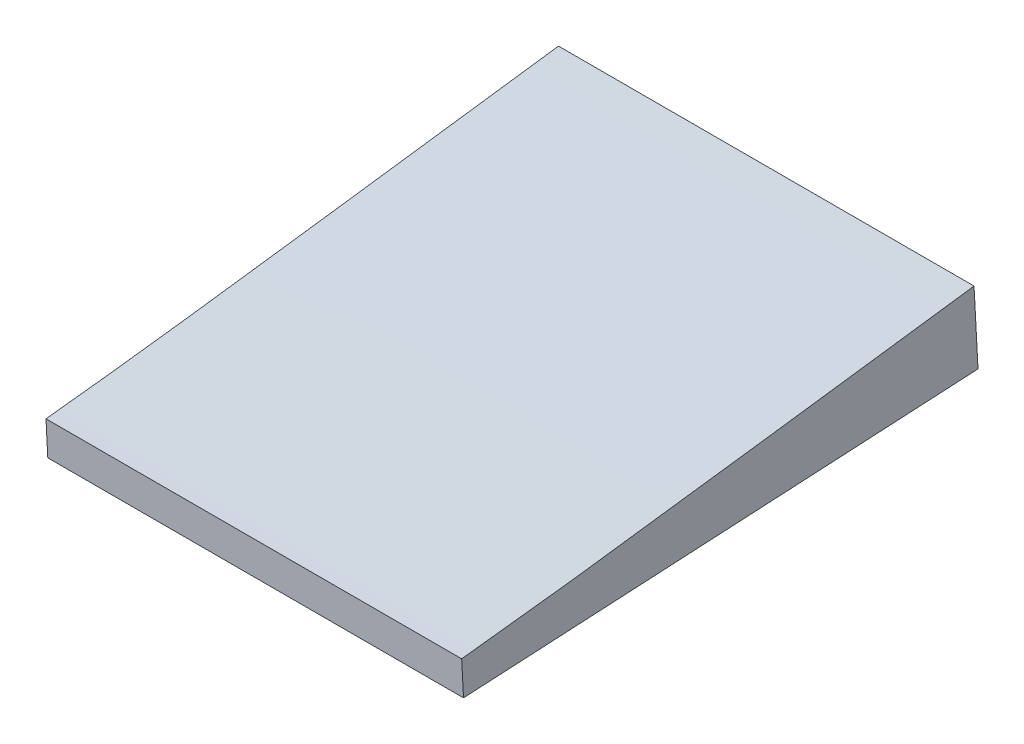
ISO-10303-21;
HEADER;
FILE_DESCRIPTION(('STEP AP214'),'2;1');
FILE_NAME('part.step','',(''),(''),'','','');
FILE_SCHEMA(('AUTOMOTIVE_DESIGN { 1 0 10303 214 1 1 1 1 }'));
ENDSEC;
DATA;
#1=APPLICATION_CONTEXT('core data for automotive mechanical design processes');
#2=APPLICATION_PROTOCOL_DEFINITION('international standard','automotive_design',2000,#1);
#3=PRODUCT_CONTEXT('',#1,'mechanical');
#4=PRODUCT('Part','Part','',(#3));
#5=PRODUCT_RELATED_PRODUCT_CATEGORY('part','',(#4));
#6=PRODUCT_DEFINITION_FORMATION('','',#4);
#7=PRODUCT_DEFINITION_CONTEXT('part definition',#1,'design');
#8=PRODUCT_DEFINITION('design','',#6,#7);
#9=PRODUCT_DEFINITION_SHAPE('','',#8);
#10=(LENGTH_UNIT() NAMED_UNIT(*) SI_UNIT(.MILLI.,.METRE.));
#11=(NAMED_UNIT(*) PLANE_ANGLE_UNIT() SI_UNIT($,.RADIAN.));
#12=(NAMED_UNIT(*) SI_UNIT($,.STERADIAN.) SOLID_ANGLE_UNIT());
#13=UNCERTAINTY_MEASURE_WITH_UNIT(LENGTH_MEASURE(1.E-05),#10,'distance_accuracy_value','');
#14=(GEOMETRIC_REPRESENTATION_CONTEXT(3) GLOBAL_UNCERTAINTY_ASSIGNED_CONTEXT((#13)) GLOBAL_UNIT_ASSIGNED_CONTEXT((#10,
#11,#12)) REPRESENTATION_CONTEXT('',''));
#15=CARTESIAN_POINT('',(0.,0.,0.));
#16=DIRECTION('',(0.,0.,1.));
#17=DIRECTION('',(1.,0.,0.));
#18=AXIS2_PLACEMENT_3D('',#15,#16,#17);
#19=CARTESIAN_POINT('',(-177.805848873745,-43.688210722732,-115.550179040921));
#20=DIRECTION('',(-2.29475219963646E-07,0.0534934907984705,-0.998568198192863));
#21=DIRECTION('',(0.,0.99856819819289,0.053493490798472));
#22=AXIS2_PLACEMENT_3D('',#19,#20,#21);
#23=PLANE('',#22);
#24=CARTESIAN_POINT('',(-339.424320676004,-41.2286300415403,-115.418381689263));
#25=CARTESIAN_POINT('',(-312.486933896687,-41.2286599807383,-115.418389483438));
#26=CARTESIAN_POINT('',(-285.549547117365,-41.2286808422066,-115.418396791316));
#27=CARTESIAN_POINT('',(-231.674773558697,-41.2287044096837,-115.418410434483));
#28=CARTESIAN_POINT('',(-204.737386779351,-41.2287071156926,-115.41841676977));
#29=CARTESIAN_POINT('',(-177.8,-41.2287007439717,-115.418422618762));
#30=B_SPLINE_CURVE_WITH_KNOTS('',3,(#24,#25,#26,#27,#28,#29),.UNSPECIFIED.,.F.,.F.,(4,2,4),(0.,
80.8121603379917,161.624320676034),.UNSPECIFIED.);
#31=CARTESIAN_POINT('',(-338.453291853417,-41.2286313501884,-115.418381982514));
#32=VERTEX_POINT('',#31);
#33=CARTESIAN_POINT('',(-177.8,-41.2287007439717,-115.418422618762));
#34=VERTEX_POINT('',#33);
#35=EDGE_CURVE('E97',#32,#34,#30,.T.);
#36=ORIENTED_EDGE('',*,*,#35,.T.);
#37=DIRECTION('',(0.,-0.99856819819289,-0.053493490798472));
#38=VECTOR('',#37,1.);
#39=CARTESIAN_POINT('',(-177.8,6.04731605634461,-112.885837288814));
#40=LINE('',#39,#38);
#41=CARTESIAN_POINT('',(-177.8,-27.7854361643582,-114.698264347082));
#42=VERTEX_POINT('',#41);
#43=EDGE_CURVE('E70',#42,#34,#40,.T.);
#44=ORIENTED_EDGE('',*,*,#43,.F.);
#45=CARTESIAN_POINT('',(-177.8,-27.7854361642381,-114.698264347069));
#46=CARTESIAN_POINT('',(-231.674773558668,-27.7854374698395,-114.698252035584));
#47=CARTESIAN_POINT('',(-285.549547117336,-27.7854387754408,-114.698239724099));
#48=CARTESIAN_POINT('',(-339.424320676004,-27.7854400810422,-114.698227412614));
#49=B_SPLINE_CURVE_WITH_KNOTS('',3,(#45,#46,#47,#48),.UNSPECIFIED.,.F.,.F.,(4,4),(0.,
161.624320676009),.UNSPECIFIED.);
#50=CARTESIAN_POINT('',(-338.421323075372,-27.7854400567378,-114.698227641805));
#51=VERTEX_POINT('',#50);
#52=EDGE_CURVE('E90',#42,#51,#49,.T.);
#53=ORIENTED_EDGE('',*,*,#52,.T.);
#54=DIRECTION('',(0.0023746530409731,0.998565382766486,0.0534933394298316));
#55=VECTOR('',#54,1.);
#56=CARTESIAN_POINT('',(-338.458234976646,-43.3072641668652,-115.529734741914));
#57=LINE('',#56,#55);
#58=EDGE_CURVE('E11',#32,#51,#57,.T.);
#59=ORIENTED_EDGE('',*,*,#58,.F.);
#60=EDGE_LOOP('',(#36,#44,#53,#59));
#61=FACE_BOUND('',#60,.T.);
#62=ADVANCED_FACE('F42',(#61),#23,.F.);
#63=CARTESIAN_POINT('',(-338.458280662959,-32.6572237938514,-314.335074741631));
#64=DIRECTION('',(-0.999997180507466,0.0023712407330619,0.000127257626607295));
#65=DIRECTION('',(-0.00237124075226243,-0.999997188604695,0.));
#66=AXIS2_PLACEMENT_3D('',#63,#64,#65);
#67=PLANE('',#66);
#68=CARTESIAN_POINT('',(-338.453293983147,-41.72770935186,-106.135603463235));
#69=CARTESIAN_POINT('',(-338.453277965832,-37.9742532380857,-175.949342672558));
#70=CARTESIAN_POINT('',(-338.453261948516,-34.2207971243114,-245.763081881881));
#71=CARTESIAN_POINT('',(-338.453245931201,-30.4673410105371,-315.576821091204));
#72=B_SPLINE_CURVE_WITH_KNOTS('',3,(#68,#69,#70,#71),.UNSPECIFIED.,.F.,.F.,(4,4),(0.,
209.743699635223),.UNSPECIFIED.);
#73=CARTESIAN_POINT('',(-338.453246242115,-30.5401994156522,-314.221665338883));
#74=VERTEX_POINT('',#73);
#75=EDGE_CURVE('E99',#32,#74,#72,.T.);
#76=ORIENTED_EDGE('',*,*,#75,.F.);
#77=ORIENTED_EDGE('',*,*,#58,.T.);
#78=CARTESIAN_POINT('',(-338.384941198785,-1.66194015910152,-315.576821091204));
#79=CARTESIAN_POINT('',(-338.385075981672,-1.75779642906582,-314.849825098571));
#80=CARTESIAN_POINT('',(-338.385210296399,-1.85345665055141,-314.122803324417));
#81=CARTESIAN_POINT('',(-338.385478660586,-2.04466601525986,-312.668745061361));
#82=CARTESIAN_POINT('',(-338.385612710047,-2.14021515846762,-311.941708572457));
#83=CARTESIAN_POINT('',(-338.385881214696,-2.33148334352403,-310.487658046608));
#84=CARTESIAN_POINT('',(-338.386015669885,-2.42720238534448,-309.760644009661));
#85=CARTESIAN_POINT('',(-338.386285495478,-2.61902371671638,-308.306666538209));
#86=CARTESIAN_POINT('',(-338.386420865882,-2.71512600624027,-307.579703103701));
#87=CARTESIAN_POINT('',(-338.386692367703,-2.9076492289872,-306.125818907187));
#88=CARTESIAN_POINT('',(-338.38682849912,-3.00407016201006,-305.398898145154));
#89=CARTESIAN_POINT('',(-338.387101455729,-3.19720253669483,-303.945095182069));
#90=CARTESIAN_POINT('',(-338.387238280921,-3.29391397837079,-303.218212981017));
#91=CARTESIAN_POINT('',(-338.387649658327,-3.58442592179664,-301.037616703996));
#92=CARTESIAN_POINT('',(-338.387925112377,-3.77860404435833,-299.583952935944));
#93=CARTESIAN_POINT('',(-338.38847775922,-4.16768707481978,-296.67674607591));
#94=CARTESIAN_POINT('',(-338.388754951987,-4.36259197120865,-295.223202982386));
#95=CARTESIAN_POINT('',(-338.38931030481,-4.75280677039573,-292.316171164598));
#96=CARTESIAN_POINT('',(-338.389588464866,-4.94811667319807,-290.862682440334));
#97=CARTESIAN_POINT('',(-338.390145538201,-5.33905186907127,-287.955747069443));
#98=CARTESIAN_POINT('',(-338.39042445148,-5.5346771622134,-286.502300422826));
#99=CARTESIAN_POINT('',(-338.390983168281,-5.92630048417527,-283.595457371246));
#100=CARTESIAN_POINT('',(-338.391262971802,-6.12229851298897,-282.142060966282));
#101=CARTESIAN_POINT('',(-338.392103868066,-6.71091264371114,-277.781992930944));
#102=CARTESIAN_POINT('',(-338.392666453562,-7.10415374231775,-274.875405636536));
#103=CARTESIAN_POINT('',(-338.393795745934,-7.89236142527868,-269.062465411846));
#104=CARTESIAN_POINT('',(-338.394362452808,-8.28732800944506,-266.156112481539));
#105=CARTESIAN_POINT('',(-338.395498561383,-9.07838752378461,-260.343595067228));
#106=CARTESIAN_POINT('',(-338.396067963052,-9.4744804405583,-257.4374305814));
#107=CARTESIAN_POINT('',(-338.397208280786,-10.2673002889964,-251.625187970172));
#108=CARTESIAN_POINT('',(-338.397779196851,-10.664027220694,-248.719109844778));
#109=CARTESIAN_POINT('',(-338.398921301874,-11.4575933768576,-242.907005604515));
#110=CARTESIAN_POINT('',(-338.399492490828,-11.8544325998718,-240.000979489447));
#111=CARTESIAN_POINT('',(-338.400633866973,-12.647691653768,-234.188870043382));
#112=CARTESIAN_POINT('',(-338.401204054163,-13.0441114846577,-231.282786712385));
#113=CARTESIAN_POINT('',(-338.402341952756,-13.8359125822929,-225.470517138633));
#114=CARTESIAN_POINT('',(-338.40290966419,-14.23129386253,-222.564330897717));
#115=CARTESIAN_POINT('',(-338.4040411686,-15.0204158974013,-216.751735518881));
#116=CARTESIAN_POINT('',(-338.404604961576,-15.4141566520009,-213.845326380958));
#117=CARTESIAN_POINT('',(-338.405727251983,-16.1994308990891,-208.032024197792));
#118=CARTESIAN_POINT('',(-338.40628574908,-16.5909642516153,-205.125131133634));
#119=CARTESIAN_POINT('',(-338.407395820899,-17.3711325438039,-199.310955877394));
#120=CARTESIAN_POINT('',(-338.407947395622,-17.7597674835314,-196.403673685321));
#121=CARTESIAN_POINT('',(-338.409041456419,-18.5332296051219,-190.588641651748));
#122=CARTESIAN_POINT('',(-338.409583942615,-18.9180568373989,-187.68089181696));
#123=CARTESIAN_POINT('',(-338.410657742576,-19.6830327381025,-181.864776104681));
#124=CARTESIAN_POINT('',(-338.411189056342,-20.0631814061935,-178.956410227147));
#125=CARTESIAN_POINT('',(-338.412238440607,-20.8179304382488,-173.138995889079));
#126=CARTESIAN_POINT('',(-338.412756511276,-21.1925308730755,-170.229947437746));
#127=CARTESIAN_POINT('',(-338.413777164157,-21.9352444232203,-164.411022162955));
#128=CARTESIAN_POINT('',(-338.414279746371,-22.3033575396108,-161.501145339635));
#129=CARTESIAN_POINT('',(-338.415266494753,-23.0318695160244,-155.680420143007));
#130=CARTESIAN_POINT('',(-338.415750660889,-23.3922683631897,-152.769571768089));
#131=CARTESIAN_POINT('',(-338.416697722633,-24.1041544968884,-146.946782645827));
#132=CARTESIAN_POINT('',(-338.417160618229,-24.4556417784358,-144.034841897873));
#133=CARTESIAN_POINT('',(-338.418062339827,-25.1485368060939,-138.209636156986));
#134=CARTESIAN_POINT('',(-338.41850116482,-25.4899441289263,-135.296371113643));
#135=CARTESIAN_POINT('',(-338.419351672289,-26.1613824062099,-129.468533980613));
#136=CARTESIAN_POINT('',(-338.419763354814,-26.4914133812213,-126.553961893298));
#137=CARTESIAN_POINT('',(-338.420555630469,-27.1384608637312,-120.72301921962));
#138=CARTESIAN_POINT('',(-338.420936219899,-27.4554758202379,-117.806648460712));
#139=CARTESIAN_POINT('',(-338.421662371313,-28.0748186139008,-111.972330205906));
#140=CARTESIAN_POINT('',(-338.422007933071,-28.3771463564517,-109.054382699974));
#141=CARTESIAN_POINT('',(-338.422334036711,-28.6713128784201,-106.135603463235));
#142=B_SPLINE_CURVE_WITH_KNOTS('',3,(#78,#79,#80,#81,#82,#83,#84,#85,#86,#87,#88,#89,#90,#91,
#92,#93,#94,#95,#96,#97,#98,#99,#100,#101,#102,#103,#104,#105,#106,#107,#108,#109,#110,#111,
#112,#113,#114,#115,#116,#117,#118,#119,#120,#121,#122,#123,#124,#125,#126,#127,#128,#129,#130,
#131,#132,#133,#134,#135,#136,#137,#138,#139,#140,#141),.UNSPECIFIED.,.F.,.F.,(4,2,2,2,2,2,2,2,
2,2,2,2,2,2,2,2,2,2,2,2,2,2,2,2,2,2,2,2,2,2,2,4),(0.,2.19986456045967,4.39972942006736,
6.59959391452863,8.79945825084345,10.9993212054151,13.1991842664468,17.598910333388,
21.9985670095008,26.3982237303883,30.7978814454017,35.1975390890999,43.9967428516797,
52.7959456558987,61.5950442142863,70.3941432320275,79.1931332542722,87.9921231163968,
96.790998102405,105.589873273976,114.389300210211,123.188726949209,131.988037027707,
140.787347737471,149.586545964881,158.385742737677,167.184954175309,175.984170535942,
184.783755869818,193.583325299607,202.383940262928,211.184611906434),.UNSPECIFIED.);
#143=CARTESIAN_POINT('',(-338.385473794122,-2.04120638245378,-312.694968806027));
#144=VERTEX_POINT('',#143);
#145=EDGE_CURVE('E93',#144,#51,#142,.T.);
#146=ORIENTED_EDGE('',*,*,#145,.F.);
#147=DIRECTION('',(0.0023746530409731,0.998565382766486,0.0534933394298316));
#148=VECTOR('',#147,1.);
#149=CARTESIAN_POINT('',(-338.458280662959,-32.6572237938514,-314.335074741631));
#150=LINE('',#149,#148);
#151=EDGE_CURVE('E48',#74,#144,#150,.T.);
#152=ORIENTED_EDGE('',*,*,#151,.F.);
#153=EDGE_LOOP('',(#76,#77,#146,#152));
#154=FACE_BOUND('',#153,.T.);
#155=ADVANCED_FACE('F140',(#154),#67,.T.);
#156=CARTESIAN_POINT('',(-177.805940246243,-33.0381702413849,-314.355519034823));
#157=DIRECTION('',(-2.29475219526301E-07,0.0534934907984705,-0.998568198192863));
#158=DIRECTION('',(0.,0.99856819819289,0.053493490798472));
#159=AXIS2_PLACEMENT_3D('',#156,#157,#158);
#160=PLANE('',#159);
#161=CARTESIAN_POINT('',(-339.4243660882,-30.5401987010888,-314.221665077456));
#162=CARTESIAN_POINT('',(-312.486971740172,-30.5402152320651,-314.221672153351));
#163=CARTESIAN_POINT('',(-285.549577392142,-30.5402267068268,-314.221678958384));
#164=CARTESIAN_POINT('',(-231.674788696076,-30.540239543921,-314.221692026726));
#165=CARTESIAN_POINT('',(-204.737394348038,-30.5402409062534,-314.221698290034));
#166=CARTESIAN_POINT('',(-177.8,-30.5402372123712,-314.22170428248));
#167=B_SPLINE_CURVE_WITH_KNOTS('',3,(#161,#162,#163,#164,#165,#166),.UNSPECIFIED.,.F.,.F.,(4,2,
4),(0.,80.8121830440984,161.624366088212),.UNSPECIFIED.);
#168=CARTESIAN_POINT('',(-177.8,-30.5402372123712,-314.22170428248));
#169=VERTEX_POINT('',#168);
#170=EDGE_CURVE('E159',#74,#169,#167,.T.);
#171=ORIENTED_EDGE('',*,*,#170,.F.);
#172=ORIENTED_EDGE('',*,*,#151,.T.);
#173=CARTESIAN_POINT('',(-177.8,-2.04120156395444,-312.695005454346));
#174=CARTESIAN_POINT('',(-231.674788696067,-2.041203180511,-312.694993159211));
#175=CARTESIAN_POINT('',(-285.549577392133,-2.04120479706756,-312.694980864076));
#176=CARTESIAN_POINT('',(-339.4243660882,-2.04120641362412,-312.694968568941));
#177=B_SPLINE_CURVE_WITH_KNOTS('',3,(#173,#174,#175,#176),.UNSPECIFIED.,.F.,.F.,(4,4),(0.,
161.624366088204),.UNSPECIFIED.);
#178=CARTESIAN_POINT('',(-177.8,-2.0412015642015,-312.695005454378));
#179=VERTEX_POINT('',#178);
#180=EDGE_CURVE('E62',#179,#144,#177,.T.);
#181=ORIENTED_EDGE('',*,*,#180,.F.);
#182=DIRECTION('',(0.,-0.99856819819289,-0.053493490798472));
#183=VECTOR('',#182,1.);
#184=CARTESIAN_POINT('',(-177.8,16.697356429359,-311.691177288541));
#185=LINE('',#184,#183);
#186=EDGE_CURVE('E95',#179,#169,#185,.T.);
#187=ORIENTED_EDGE('',*,*,#186,.T.);
#188=EDGE_LOOP('',(#171,#172,#181,#187));
#189=FACE_BOUND('',#188,.T.);
#190=ADVANCED_FACE('F145',(#189),#160,.T.);
#191=CARTESIAN_POINT('',(-177.8,-19.8517756392125,-513.024949519574));
#192=CARTESIAN_POINT('',(-230.927822670913,-19.8517756392131,-513.024949519573));
#193=CARTESIAN_POINT('',(-327.221843777014,-19.85177556461,-513.024949512121));
#194=CARTESIAN_POINT('',(-429.163295145268,-19.851747405451,-513.02494669903));
#195=CARTESIAN_POINT('',(-478.37373551928,-19.8553917991521,-513.025310773422));
#196=CARTESIAN_POINT('',(-484.526566689,-19.8509810482507,-513.024870140049));
#197=CARTESIAN_POINT('',(-485.325724035843,-19.8616136905836,-513.025932339458));
#198=CARTESIAN_POINT('',(-485.74220278189,-19.8504556461254,-513.024817652453));
#199=CARTESIAN_POINT('',(-486.055073478805,-19.837998853289,-513.023573220676));
#200=CARTESIAN_POINT('',(-486.721023025963,-19.7896920332219,-513.018747376438));
#201=CARTESIAN_POINT('',(-488.005895224868,-19.7156619716598,-513.011351784149));
#202=CARTESIAN_POINT('',(-489.990982303435,-19.5950176463225,-512.999299433747));
#203=CARTESIAN_POINT('',(-493.418075753209,-19.3845673435656,-512.978275479375));
#204=CARTESIAN_POINT('',(-496.275498294021,-19.2098686829378,-512.960823108809));
#205=CARTESIAN_POINT('',(-498.171448850375,-19.093967149797,-512.949244562662));
#206=CARTESIAN_POINT('',(-177.8,-30.0585978788049,-323.180099453892));
#207=CARTESIAN_POINT('',(-230.855154718641,-30.058770737324,-323.176884320058));
#208=CARTESIAN_POINT('',(-327.016912296079,-30.0590839881502,-323.17105699538));
#209=CARTESIAN_POINT('',(-429.020294549715,-30.0592878861405,-323.164847100743));
#210=CARTESIAN_POINT('',(-478.353129811688,-30.0588050980014,-323.162018312611));
#211=CARTESIAN_POINT('',(-484.523199500304,-30.0600534699108,-323.161427333636));
#212=CARTESIAN_POINT('',(-485.324580302747,-30.0690959154497,-323.162123856821));
#213=CARTESIAN_POINT('',(-485.74206530166,-30.058202792822,-323.161289082879));
#214=CARTESIAN_POINT('',(-486.056022391488,-30.0459749246713,-323.160365123254));
#215=CARTESIAN_POINT('',(-486.726854468382,-29.9977980837545,-323.15680071936));
#216=CARTESIAN_POINT('',(-488.035171334072,-29.9232183577818,-323.151304954233));
#217=CARTESIAN_POINT('',(-490.096684748401,-29.8002690608145,-323.142321356302));
#218=CARTESIAN_POINT('',(-493.765994874844,-29.5795426148951,-323.126513034935));
#219=CARTESIAN_POINT('',(-496.972926582145,-29.3872285713691,-323.113188483415));
#220=CARTESIAN_POINT('',(-499.062687476354,-29.2618726277478,-323.104398152242));
#221=CARTESIAN_POINT('',(-177.8,-40.2654201183974,-133.335249388211));
#222=CARTESIAN_POINT('',(-230.78248676637,-40.2657658354349,-133.328819120543));
#223=CARTESIAN_POINT('',(-326.811980815146,-40.2663924116903,-133.317164478639));
#224=CARTESIAN_POINT('',(-428.877293954164,-40.26682836683,-133.304747502456));
#225=CARTESIAN_POINT('',(-478.332524104096,-40.2622183968507,-133.298725851801));
#226=CARTESIAN_POINT('',(-484.519832311607,-40.2691258915708,-133.297984527223));
#227=CARTESIAN_POINT('',(-485.323436569652,-40.2765781403158,-133.298315374185));
#228=CARTESIAN_POINT('',(-485.741927821432,-40.2659499395185,-133.297760513305));
#229=CARTESIAN_POINT('',(-486.056971304171,-40.2539509960537,-133.297157025832));
#230=CARTESIAN_POINT('',(-486.732685910802,-40.205904134287,-133.294854062282));
#231=CARTESIAN_POINT('',(-488.064447443276,-40.1307747439037,-133.291258124317));
#232=CARTESIAN_POINT('',(-490.202387193366,-40.0055204753064,-133.285343278857));
#233=CARTESIAN_POINT('',(-494.11391399648,-39.7745178862246,-133.274750590496));
#234=CARTESIAN_POINT('',(-497.670354870269,-39.5645884598005,-133.265553858022));
#235=CARTESIAN_POINT('',(-499.953926102333,-39.4297781056986,-133.259551741823));
#236=CARTESIAN_POINT('',(-177.8,-50.4722423579898,56.5096006774697));
#237=CARTESIAN_POINT('',(-230.709818814098,-50.4727609335458,56.5192460789722));
#238=CARTESIAN_POINT('',(-326.607049334211,-50.4737008352305,56.5367280381017));
#239=CARTESIAN_POINT('',(-428.734293358612,-50.4743688475195,56.5553520958316));
#240=CARTESIAN_POINT('',(-478.311918396505,-50.4656316957,56.5645666090093));
#241=CARTESIAN_POINT('',(-484.51646512291,-50.4781983132309,56.5654582791896));
#242=CARTESIAN_POINT('',(-485.322292836556,-50.4840603651819,56.565493108451));
#243=CARTESIAN_POINT('',(-485.741790341202,-50.4736970862151,56.5657680562688));
#244=CARTESIAN_POINT('',(-486.057920216853,-50.461927067436,56.5660510715899));
#245=CARTESIAN_POINT('',(-486.738517353221,-50.4140101848196,56.5670925947966));
#246=CARTESIAN_POINT('',(-488.09372355248,-50.3383311300257,56.5687887055985));
#247=CARTESIAN_POINT('',(-490.308089638331,-50.2107718897984,56.5716347985879));
#248=CARTESIAN_POINT('',(-494.461833118115,-49.969493157554,56.5770118539443));
#249=CARTESIAN_POINT('',(-498.367783158393,-49.7419483482318,56.5820807673716));
#250=CARTESIAN_POINT('',(-500.845164728312,-49.5976835836494,56.5852946685971));
#251=B_SPLINE_SURFACE_WITH_KNOTS('',3,3,((#191,#192,#193,#194,#195,#196,#197,#198,#199,#200,
#201,#202,#203,#204,#205),(#206,#207,#208,#209,#210,#211,#212,#213,#214,#215,#216,#217,#218,
#219,#220),(#221,#222,#223,#224,#225,#226,#227,#228,#229,#230,#231,#232,#233,#234,#235),(#236,
#237,#238,#239,#240,#241,#242,#243,#244,#245,#246,#247,#248,#249,#250)),.UNSPECIFIED.,.F.,.F.,
.F.,(4,4),(4,1,1,1,1,1,1,1,1,1,1,1,4),(0.,1.),(0.,0.5,0.90625,0.95703125,0.9609375,0.9638671875,
0.96450845898134,0.96484375,0.966796875,0.970703125,0.9765625,0.984375,1.),.UNSPECIFIED.);
#252=DIRECTION('',(0.,-0.0536864833252265,0.998557840842567));
#253=VECTOR('',#252,1.);
#254=CARTESIAN_POINT('',(-177.8,-19.8517756392125,-513.024949519574));
#255=LINE('',#254,#253);
#256=EDGE_CURVE('E54',#169,#34,#255,.T.);
#257=ORIENTED_EDGE('',*,*,#75,.T.);
#258=ORIENTED_EDGE('',*,*,#170,.T.);
#259=ORIENTED_EDGE('',*,*,#256,.T.);
#260=ORIENTED_EDGE('',*,*,#35,.F.);
#261=EDGE_LOOP('',(#257,#258,#259,#260));
#262=FACE_BOUND('',#261,.T.);
#263=ADVANCED_FACE('F162',(#262),#251,.T.);
#264=CARTESIAN_POINT('',(-177.8,0.,0.));
#265=DIRECTION('',(-1.,0.,0.));
#266=DIRECTION('',(0.,0.,1.));
#267=AXIS2_PLACEMENT_3D('',#264,#265,#266);
#268=PLANE('',#267);
#269=CARTESIAN_POINT('',(-177.8,-6.51913907058263,69.5663617744474));
#270=CARTESIAN_POINT('',(-177.8,-6.88721273253516,69.4883910827677));
#271=CARTESIAN_POINT('',(-177.8,-7.61052758633523,69.3363760132391));
#272=CARTESIAN_POINT('',(-177.8,-8.76184326811464,69.0354225894495));
#273=CARTESIAN_POINT('',(-177.8,-9.88259406782119,68.626070203946));
#274=CARTESIAN_POINT('',(-177.8,-12.021228930256,67.6619851025588));
#275=CARTESIAN_POINT('',(-177.8,-14.9546020256939,65.6923130131807));
#276=CARTESIAN_POINT('',(-177.8,-18.1374494761777,62.3412188200519));
#277=CARTESIAN_POINT('',(-177.8,-21.5964876349103,57.3382189268778));
#278=CARTESIAN_POINT('',(-177.8,-24.7903629698325,50.5220499235312));
#279=CARTESIAN_POINT('',(-177.8,-27.5359775514862,42.0059138994073));
#280=CARTESIAN_POINT('',(-177.8,-29.5513425657538,33.3240400078997));
#281=CARTESIAN_POINT('',(-177.8,-31.532992144648,21.6352015564033));
#282=CARTESIAN_POINT('',(-177.8,-33.0186008410447,6.91344102508237));
#283=CARTESIAN_POINT('',(-177.8,-33.7765423596692,-10.7972873340441));
#284=CARTESIAN_POINT('',(-177.8,-33.7950491418743,-28.5097311954228));
#285=CARTESIAN_POINT('',(-177.8,-33.2586088383385,-46.2043865238911));
#286=CARTESIAN_POINT('',(-177.8,-31.9669194489648,-69.7641945581866));
#287=CARTESIAN_POINT('',(-177.8,-29.5034076215053,-99.1460197389462));
#288=CARTESIAN_POINT('',(-177.8,-25.6933715620582,-134.308212307564));
#289=CARTESIAN_POINT('',(-177.8,-21.3490549530988,-169.399514794737));
#290=CARTESIAN_POINT('',(-177.8,-16.7038848255612,-204.446464420127));
#291=CARTESIAN_POINT('',(-177.8,-11.9288122826792,-239.471434511741));
#292=CARTESIAN_POINT('',(-177.8,-7.93942067939684,-268.654643904962));
#293=CARTESIAN_POINT('',(-177.8,-4.79172290140647,-292.007732636027));
#294=CARTESIAN_POINT('',(-177.8,-2.83780100098235,-306.600292672818));
#295=CARTESIAN_POINT('',(-177.8,-1.30907436693598,-318.288997719976));
#296=CARTESIAN_POINT('',(-177.8,0.263068831943658,-329.949567815073));
#297=CARTESIAN_POINT('',(-177.8,1.719295513011,-344.570295270056));
#298=CARTESIAN_POINT('',(-177.8,2.80506666571039,-362.175990442094));
#299=CARTESIAN_POINT('',(-177.8,3.31793184017618,-385.687405296962));
#300=CARTESIAN_POINT('',(-177.8,2.25388387982141,-415.082460117617));
#301=CARTESIAN_POINT('',(-177.8,-0.960221939673565,-444.321872591633));
#302=CARTESIAN_POINT('',(-177.8,-4.72777257870521,-467.542126740326));
#303=CARTESIAN_POINT('',(-177.8,-6.96557190432381,-479.089279042028));
#304=CARTESIAN_POINT('',(-177.8,-8.1921973731203,-484.839703055914));
#305=B_SPLINE_CURVE_WITH_KNOTS('',3,(#269,#270,#271,#272,#273,#274,#275,#276,#277,#278,#279,
#280,#281,#282,#283,#284,#285,#286,#287,#288,#289,#290,#291,#292,#293,#294,#295,#296,#297,#298,
#299,#300,#301,#302,#303,#304),.UNSPECIFIED.,.F.,.F.,(4,1,1,1,1,1,1,1,1,1,1,1,1,1,1,1,1,1,1,1,1,
1,1,1,1,1,1,1,1,1,1,1,1,4),(-6.87555594952044E-05,0.00188450372870693,0.00383776301690907,
0.00579102230511121,0.00774428159331335,0.0155573187461219,0.0233703558989304,0.031183393051739,
0.0468094673573561,0.0624355416629732,0.0780616159685904,0.0936876902742075,0.124939838885442,
0.156191987496676,0.18744413610791,0.218696284719144,0.249948433330378,0.312452730552847,
0.374957027775315,0.437461324997784,0.499965622220252,0.562469919442721,0.624974216665189,
0.656226365276424,0.687478513887658,0.703104588193275,0.718730662498892,0.749982811110126,
0.78123495972136,0.812487108332595,0.874991405555063,0.937495702777532,0.968747851388766,1.),.UNSPECIFIED.);
#306=EDGE_CURVE('E91',#42,#179,#305,.T.);
#307=ORIENTED_EDGE('',*,*,#306,.F.);
#308=ORIENTED_EDGE('',*,*,#43,.T.);
#309=ORIENTED_EDGE('',*,*,#256,.F.);
#310=ORIENTED_EDGE('',*,*,#186,.F.);
#311=EDGE_LOOP('',(#307,#308,#309,#310));
#312=FACE_BOUND('',#311,.T.);
#313=ADVANCED_FACE('F101',(#312),#268,.F.);
#314=DIRECTION('',(-1.,0.,0.));
#315=VECTOR('',#314,1.);
#316=SURFACE_OF_LINEAR_EXTRUSION('',#305,#315);
#317=ORIENTED_EDGE('',*,*,#306,.T.);
#318=ORIENTED_EDGE('',*,*,#180,.T.);
#319=ORIENTED_EDGE('',*,*,#145,.T.);
#320=ORIENTED_EDGE('',*,*,#52,.F.);
#321=EDGE_LOOP('',(#317,#318,#319,#320));
#322=FACE_BOUND('',#321,.T.);
#323=ADVANCED_FACE('F44',(#322),#316,.T.);
#324=CLOSED_SHELL('',(#62,#155,#190,#263,#313,#323));
#325=MANIFOLD_SOLID_BREP('B2',#324);
#326=ADVANCED_BREP_SHAPE_REPRESENTATION('',(#18,#325),#14);
#327=SHAPE_DEFINITION_REPRESENTATION(#9,#326);
ENDSEC;
END-ISO-10303-21;
